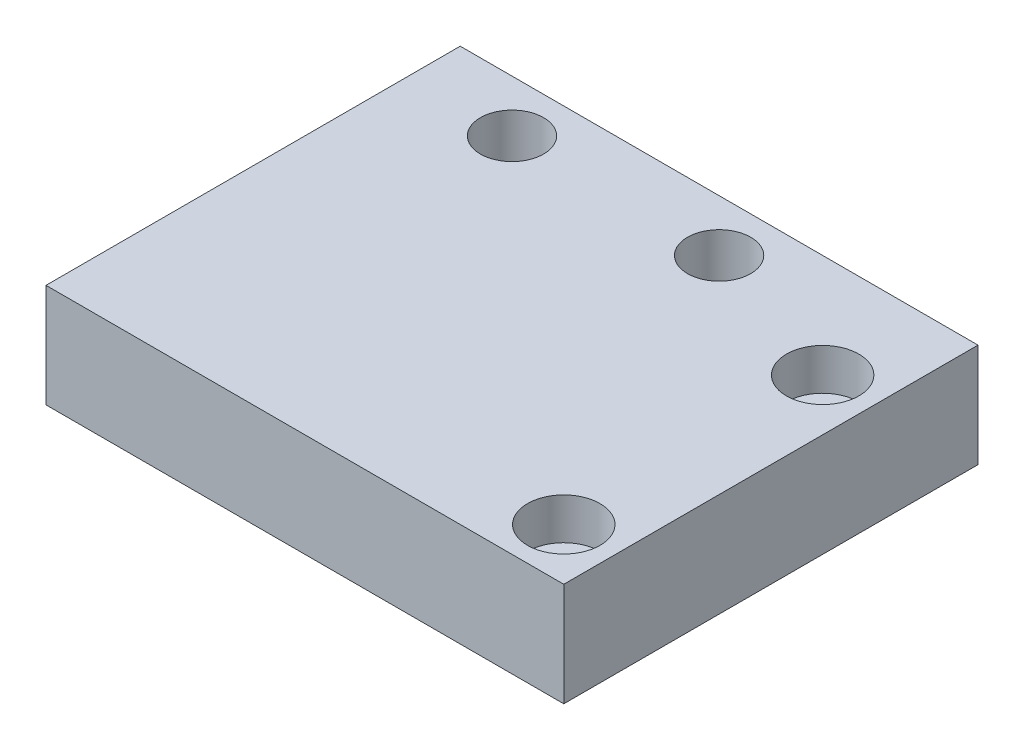
ISO-10303-21;
HEADER;
FILE_DESCRIPTION(('STEP AP214'),'2;1');
FILE_NAME('part.step','',(''),(''),'','','');
FILE_SCHEMA(('AUTOMOTIVE_DESIGN { 1 0 10303 214 1 1 1 1 }'));
ENDSEC;
DATA;
#1=APPLICATION_CONTEXT('core data for automotive mechanical design processes');
#2=APPLICATION_PROTOCOL_DEFINITION('international standard','automotive_design',2000,#1);
#3=PRODUCT_CONTEXT('',#1,'mechanical');
#4=PRODUCT('Part','Part','',(#3));
#5=PRODUCT_RELATED_PRODUCT_CATEGORY('part','',(#4));
#6=PRODUCT_DEFINITION_FORMATION('','',#4);
#7=PRODUCT_DEFINITION_CONTEXT('part definition',#1,'design');
#8=PRODUCT_DEFINITION('design','',#6,#7);
#9=PRODUCT_DEFINITION_SHAPE('','',#8);
#10=(LENGTH_UNIT() NAMED_UNIT(*) SI_UNIT(.MILLI.,.METRE.));
#11=(NAMED_UNIT(*) PLANE_ANGLE_UNIT() SI_UNIT($,.RADIAN.));
#12=(NAMED_UNIT(*) SI_UNIT($,.STERADIAN.) SOLID_ANGLE_UNIT());
#13=UNCERTAINTY_MEASURE_WITH_UNIT(LENGTH_MEASURE(1.E-05),#10,'distance_accuracy_value','');
#14=(GEOMETRIC_REPRESENTATION_CONTEXT(3) GLOBAL_UNCERTAINTY_ASSIGNED_CONTEXT((#13)) GLOBAL_UNIT_ASSIGNED_CONTEXT((#10,
#11,#12)) REPRESENTATION_CONTEXT('',''));
#15=CARTESIAN_POINT('',(0.,0.,0.));
#16=DIRECTION('',(0.,0.,1.));
#17=DIRECTION('',(1.,0.,0.));
#18=AXIS2_PLACEMENT_3D('',#15,#16,#17);
#19=CARTESIAN_POINT('',(20.,-5.65685424949239,15.));
#20=DIRECTION('',(0.,1.,0.));
#21=DIRECTION('',(0.,0.,1.));
#22=AXIS2_PLACEMENT_3D('',#19,#20,#21);
#23=CYLINDRICAL_SURFACE('',#22,2.);
#24=CARTESIAN_POINT('',(20.,0.,15.));
#25=DIRECTION('',(0.,1.,0.));
#26=DIRECTION('',(0.,0.,1.));
#27=AXIS2_PLACEMENT_3D('',#24,#25,#26);
#28=CIRCLE('',#27,2.);
#29=CARTESIAN_POINT('',(20.,0.,17.));
#30=VERTEX_POINT('',#29);
#31=EDGE_CURVE('E112',#30,#30,#28,.F.);
#32=ORIENTED_EDGE('',*,*,#31,.T.);
#33=EDGE_LOOP('',(#32));
#34=FACE_BOUND('',#33,.T.);
#35=CARTESIAN_POINT('',(20.,6.,15.));
#36=DIRECTION('',(0.,1.,0.));
#37=DIRECTION('',(0.,0.,1.));
#38=AXIS2_PLACEMENT_3D('',#35,#36,#37);
#39=CIRCLE('',#38,2.);
#40=CARTESIAN_POINT('',(20.,6.,17.));
#41=VERTEX_POINT('',#40);
#42=EDGE_CURVE('E39',#41,#41,#39,.F.);
#43=ORIENTED_EDGE('',*,*,#42,.F.);
#44=EDGE_LOOP('',(#43));
#45=FACE_BOUND('',#44,.T.);
#46=ADVANCED_FACE('F35',(#34,#45),#23,.F.);
#47=CARTESIAN_POINT('',(20.,-5.79827560572969,-9.99999999999999));
#48=DIRECTION('',(0.,1.,0.));
#49=DIRECTION('',(0.,0.,1.));
#50=AXIS2_PLACEMENT_3D('',#47,#48,#49);
#51=CYLINDRICAL_SURFACE('',#50,2.05);
#52=CARTESIAN_POINT('',(20.,0.,-9.99999999999999));
#53=DIRECTION('',(0.,1.,0.));
#54=DIRECTION('',(0.,0.,1.));
#55=AXIS2_PLACEMENT_3D('',#52,#53,#54);
#56=CIRCLE('',#55,2.05);
#57=CARTESIAN_POINT('',(20.,0.,-7.94999999999999));
#58=VERTEX_POINT('',#57);
#59=EDGE_CURVE('E105',#58,#58,#56,.F.);
#60=ORIENTED_EDGE('',*,*,#59,.T.);
#61=EDGE_LOOP('',(#60));
#62=FACE_BOUND('',#61,.T.);
#63=CARTESIAN_POINT('',(20.,6.,-9.99999999999999));
#64=DIRECTION('',(0.,1.,0.));
#65=DIRECTION('',(0.,0.,1.));
#66=AXIS2_PLACEMENT_3D('',#63,#64,#65);
#67=CIRCLE('',#66,2.05);
#68=CARTESIAN_POINT('',(20.,6.,-7.94999999999999));
#69=VERTEX_POINT('',#68);
#70=EDGE_CURVE('E110',#69,#69,#67,.F.);
#71=ORIENTED_EDGE('',*,*,#70,.F.);
#72=EDGE_LOOP('',(#71));
#73=FACE_BOUND('',#72,.T.);
#74=ADVANCED_FACE('F144',(#62,#73),#51,.F.);
#75=CARTESIAN_POINT('',(25.,10.,-20.));
#76=DIRECTION('',(-1.,0.,0.));
#77=DIRECTION('',(0.,0.,1.));
#78=AXIS2_PLACEMENT_3D('',#75,#76,#77);
#79=PLANE('',#78);
#80=DIRECTION('',(0.,0.,-1.));
#81=VECTOR('',#80,1.);
#82=CARTESIAN_POINT('',(25.,0.,-20.));
#83=LINE('',#82,#81);
#84=CARTESIAN_POINT('',(25.,0.,20.));
#85=VERTEX_POINT('',#84);
#86=CARTESIAN_POINT('',(25.,0.,-20.));
#87=VERTEX_POINT('',#86);
#88=EDGE_CURVE('E102',#85,#87,#83,.T.);
#89=ORIENTED_EDGE('',*,*,#88,.T.);
#90=DIRECTION('',(0.,-1.,0.));
#91=VECTOR('',#90,1.);
#92=CARTESIAN_POINT('',(25.,10.,-20.));
#93=LINE('',#92,#91);
#94=CARTESIAN_POINT('',(25.,10.,-20.));
#95=VERTEX_POINT('',#94);
#96=EDGE_CURVE('E11',#95,#87,#93,.T.);
#97=ORIENTED_EDGE('',*,*,#96,.F.);
#98=DIRECTION('',(0.,0.,-1.));
#99=VECTOR('',#98,1.);
#100=CARTESIAN_POINT('',(25.,10.,-20.));
#101=LINE('',#100,#99);
#102=CARTESIAN_POINT('',(25.,10.,20.));
#103=VERTEX_POINT('',#102);
#104=EDGE_CURVE('E89',#103,#95,#101,.T.);
#105=ORIENTED_EDGE('',*,*,#104,.F.);
#106=DIRECTION('',(0.,-1.,0.));
#107=VECTOR('',#106,1.);
#108=CARTESIAN_POINT('',(25.,10.,20.));
#109=LINE('',#108,#107);
#110=EDGE_CURVE('E98',#103,#85,#109,.T.);
#111=ORIENTED_EDGE('',*,*,#110,.T.);
#112=EDGE_LOOP('',(#89,#97,#105,#111));
#113=FACE_BOUND('',#112,.T.);
#114=ADVANCED_FACE('F37',(#113),#79,.F.);
#115=CARTESIAN_POINT('',(-25.,10.,-20.));
#116=DIRECTION('',(0.,0.,1.));
#117=DIRECTION('',(1.,0.,0.));
#118=AXIS2_PLACEMENT_3D('',#115,#116,#117);
#119=PLANE('',#118);
#120=DIRECTION('',(-1.,0.,0.));
#121=VECTOR('',#120,1.);
#122=CARTESIAN_POINT('',(-25.,0.,-20.));
#123=LINE('',#122,#121);
#124=CARTESIAN_POINT('',(-25.,0.,-20.));
#125=VERTEX_POINT('',#124);
#126=EDGE_CURVE('E93',#87,#125,#123,.T.);
#127=ORIENTED_EDGE('',*,*,#126,.T.);
#128=DIRECTION('',(0.,-1.,0.));
#129=VECTOR('',#128,1.);
#130=CARTESIAN_POINT('',(-25.,10.,-20.));
#131=LINE('',#130,#129);
#132=CARTESIAN_POINT('',(-25.,10.,-20.));
#133=VERTEX_POINT('',#132);
#134=EDGE_CURVE('E45',#133,#125,#131,.T.);
#135=ORIENTED_EDGE('',*,*,#134,.F.);
#136=DIRECTION('',(-1.,0.,0.));
#137=VECTOR('',#136,1.);
#138=CARTESIAN_POINT('',(-25.,10.,-20.));
#139=LINE('',#138,#137);
#140=EDGE_CURVE('E84',#95,#133,#139,.T.);
#141=ORIENTED_EDGE('',*,*,#140,.F.);
#142=ORIENTED_EDGE('',*,*,#96,.T.);
#143=EDGE_LOOP('',(#127,#135,#141,#142));
#144=FACE_BOUND('',#143,.T.);
#145=ADVANCED_FACE('F92',(#144),#119,.F.);
#146=CARTESIAN_POINT('',(-25.,10.,-20.));
#147=DIRECTION('',(1.,0.,0.));
#148=DIRECTION('',(0.,0.,-1.));
#149=AXIS2_PLACEMENT_3D('',#146,#147,#148);
#150=PLANE('',#149);
#151=DIRECTION('',(0.,0.,1.));
#152=VECTOR('',#151,1.);
#153=CARTESIAN_POINT('',(-25.,0.,-20.));
#154=LINE('',#153,#152);
#155=CARTESIAN_POINT('',(-25.,0.,20.));
#156=VERTEX_POINT('',#155);
#157=EDGE_CURVE('E71',#125,#156,#154,.T.);
#158=ORIENTED_EDGE('',*,*,#157,.T.);
#159=DIRECTION('',(0.,-1.,0.));
#160=VECTOR('',#159,1.);
#161=CARTESIAN_POINT('',(-25.,10.,20.));
#162=LINE('',#161,#160);
#163=CARTESIAN_POINT('',(-25.,10.,20.));
#164=VERTEX_POINT('',#163);
#165=EDGE_CURVE('E94',#164,#156,#162,.T.);
#166=ORIENTED_EDGE('',*,*,#165,.F.);
#167=DIRECTION('',(0.,0.,1.));
#168=VECTOR('',#167,1.);
#169=CARTESIAN_POINT('',(-25.,10.,-20.));
#170=LINE('',#169,#168);
#171=EDGE_CURVE('E87',#133,#164,#170,.T.);
#172=ORIENTED_EDGE('',*,*,#171,.F.);
#173=ORIENTED_EDGE('',*,*,#134,.T.);
#174=EDGE_LOOP('',(#158,#166,#172,#173));
#175=FACE_BOUND('',#174,.T.);
#176=ADVANCED_FACE('F96',(#175),#150,.F.);
#177=CARTESIAN_POINT('',(-25.,10.,20.));
#178=DIRECTION('',(0.,0.,-1.));
#179=DIRECTION('',(-1.,0.,0.));
#180=AXIS2_PLACEMENT_3D('',#177,#178,#179);
#181=PLANE('',#180);
#182=DIRECTION('',(1.,0.,0.));
#183=VECTOR('',#182,1.);
#184=CARTESIAN_POINT('',(-25.,0.,20.));
#185=LINE('',#184,#183);
#186=EDGE_CURVE('E77',#156,#85,#185,.T.);
#187=ORIENTED_EDGE('',*,*,#186,.T.);
#188=ORIENTED_EDGE('',*,*,#110,.F.);
#189=DIRECTION('',(1.,0.,0.));
#190=VECTOR('',#189,1.);
#191=CARTESIAN_POINT('',(-25.,10.,20.));
#192=LINE('',#191,#190);
#193=EDGE_CURVE('E54',#164,#103,#192,.T.);
#194=ORIENTED_EDGE('',*,*,#193,.F.);
#195=ORIENTED_EDGE('',*,*,#165,.T.);
#196=EDGE_LOOP('',(#187,#188,#194,#195));
#197=FACE_BOUND('',#196,.T.);
#198=ADVANCED_FACE('F155',(#197),#181,.F.);
#199=CARTESIAN_POINT('',(0.,10.,0.));
#200=DIRECTION('',(0.,1.,0.));
#201=DIRECTION('',(0.,0.,1.));
#202=AXIS2_PLACEMENT_3D('',#199,#200,#201);
#203=PLANE('',#202);
#204=CARTESIAN_POINT('',(20.,10.,15.));
#205=DIRECTION('',(0.,1.,0.));
#206=DIRECTION('',(0.,0.,1.));
#207=AXIS2_PLACEMENT_3D('',#204,#205,#206);
#208=CIRCLE('',#207,3.5);
#209=CARTESIAN_POINT('',(20.,10.,18.5));
#210=VERTEX_POINT('',#209);
#211=EDGE_CURVE('E127',#210,#210,#208,.T.);
#212=ORIENTED_EDGE('',*,*,#211,.F.);
#213=EDGE_LOOP('',(#212));
#214=FACE_BOUND('',#213,.T.);
#215=CARTESIAN_POINT('',(20.,10.,-9.99999999999999));
#216=DIRECTION('',(0.,1.,0.));
#217=DIRECTION('',(0.,0.,1.));
#218=AXIS2_PLACEMENT_3D('',#215,#216,#217);
#219=CIRCLE('',#218,3.5);
#220=CARTESIAN_POINT('',(20.,10.,-6.5));
#221=VERTEX_POINT('',#220);
#222=EDGE_CURVE('E120',#221,#221,#219,.T.);
#223=ORIENTED_EDGE('',*,*,#222,.F.);
#224=EDGE_LOOP('',(#223));
#225=FACE_BOUND('',#224,.T.);
#226=CARTESIAN_POINT('',(-15.,10.,-15.));
#227=DIRECTION('',(0.,1.,0.));
#228=DIRECTION('',(0.,0.,1.));
#229=AXIS2_PLACEMENT_3D('',#226,#227,#228);
#230=CIRCLE('',#229,3.05);
#231=CARTESIAN_POINT('',(-15.,10.,-11.95));
#232=VERTEX_POINT('',#231);
#233=EDGE_CURVE('E130',#232,#232,#230,.T.);
#234=ORIENTED_EDGE('',*,*,#233,.F.);
#235=EDGE_LOOP('',(#234));
#236=FACE_BOUND('',#235,.T.);
#237=CARTESIAN_POINT('',(5.,10.,-15.));
#238=DIRECTION('',(0.,1.,0.));
#239=DIRECTION('',(0.,0.,1.));
#240=AXIS2_PLACEMENT_3D('',#237,#238,#239);
#241=CIRCLE('',#240,3.05);
#242=CARTESIAN_POINT('',(5.,10.,-11.95));
#243=VERTEX_POINT('',#242);
#244=EDGE_CURVE('E117',#243,#243,#241,.T.);
#245=ORIENTED_EDGE('',*,*,#244,.F.);
#246=EDGE_LOOP('',(#245));
#247=FACE_BOUND('',#246,.T.);
#248=ORIENTED_EDGE('',*,*,#104,.T.);
#249=ORIENTED_EDGE('',*,*,#140,.T.);
#250=ORIENTED_EDGE('',*,*,#171,.T.);
#251=ORIENTED_EDGE('',*,*,#193,.T.);
#252=EDGE_LOOP('',(#248,#249,#250,#251));
#253=FACE_BOUND('',#252,.T.);
#254=ADVANCED_FACE('F85',(#214,#225,#236,#247,#253),#203,.T.);
#255=CARTESIAN_POINT('',(0.,0.,0.));
#256=DIRECTION('',(0.,1.,0.));
#257=DIRECTION('',(0.,0.,1.));
#258=AXIS2_PLACEMENT_3D('',#255,#256,#257);
#259=PLANE('',#258);
#260=ORIENTED_EDGE('',*,*,#31,.F.);
#261=EDGE_LOOP('',(#260));
#262=FACE_BOUND('',#261,.T.);
#263=CARTESIAN_POINT('',(-15.,0.,-15.));
#264=DIRECTION('',(0.,1.,0.));
#265=DIRECTION('',(0.,0.,1.));
#266=AXIS2_PLACEMENT_3D('',#263,#264,#265);
#267=CIRCLE('',#266,3.05);
#268=CARTESIAN_POINT('',(-15.,0.,-11.95));
#269=VERTEX_POINT('',#268);
#270=EDGE_CURVE('E133',#269,#269,#267,.F.);
#271=ORIENTED_EDGE('',*,*,#270,.F.);
#272=EDGE_LOOP('',(#271));
#273=FACE_BOUND('',#272,.T.);
#274=CARTESIAN_POINT('',(5.,0.,-15.));
#275=DIRECTION('',(0.,1.,0.));
#276=DIRECTION('',(0.,0.,1.));
#277=AXIS2_PLACEMENT_3D('',#274,#275,#276);
#278=CIRCLE('',#277,3.05);
#279=CARTESIAN_POINT('',(5.,0.,-11.95));
#280=VERTEX_POINT('',#279);
#281=EDGE_CURVE('E134',#280,#280,#278,.F.);
#282=ORIENTED_EDGE('',*,*,#281,.F.);
#283=EDGE_LOOP('',(#282));
#284=FACE_BOUND('',#283,.T.);
#285=ORIENTED_EDGE('',*,*,#59,.F.);
#286=EDGE_LOOP('',(#285));
#287=FACE_BOUND('',#286,.T.);
#288=ORIENTED_EDGE('',*,*,#88,.F.);
#289=ORIENTED_EDGE('',*,*,#186,.F.);
#290=ORIENTED_EDGE('',*,*,#157,.F.);
#291=ORIENTED_EDGE('',*,*,#126,.F.);
#292=EDGE_LOOP('',(#288,#289,#290,#291));
#293=FACE_BOUND('',#292,.T.);
#294=ADVANCED_FACE('F147',(#262,#273,#284,#287,#293),#259,.F.);
#295=CARTESIAN_POINT('',(5.,-8.62670273047588,-15.));
#296=DIRECTION('',(0.,1.,0.));
#297=DIRECTION('',(0.,0.,1.));
#298=AXIS2_PLACEMENT_3D('',#295,#296,#297);
#299=CYLINDRICAL_SURFACE('',#298,3.05);
#300=ORIENTED_EDGE('',*,*,#281,.T.);
#301=EDGE_LOOP('',(#300));
#302=FACE_BOUND('',#301,.T.);
#303=ORIENTED_EDGE('',*,*,#244,.T.);
#304=EDGE_LOOP('',(#303));
#305=FACE_BOUND('',#304,.T.);
#306=ADVANCED_FACE('F150',(#302,#305),#299,.F.);
#307=CARTESIAN_POINT('',(-15.,-8.62670273047588,-15.));
#308=DIRECTION('',(0.,1.,0.));
#309=DIRECTION('',(0.,0.,1.));
#310=AXIS2_PLACEMENT_3D('',#307,#308,#309);
#311=CYLINDRICAL_SURFACE('',#310,3.05);
#312=ORIENTED_EDGE('',*,*,#270,.T.);
#313=EDGE_LOOP('',(#312));
#314=FACE_BOUND('',#313,.T.);
#315=ORIENTED_EDGE('',*,*,#233,.T.);
#316=EDGE_LOOP('',(#315));
#317=FACE_BOUND('',#316,.T.);
#318=ADVANCED_FACE('F177',(#314,#317),#311,.F.);
#319=CARTESIAN_POINT('',(20.,6.,-9.99999999999999));
#320=DIRECTION('',(0.,1.,0.));
#321=DIRECTION('',(0.,0.,1.));
#322=AXIS2_PLACEMENT_3D('',#319,#320,#321);
#323=PLANE('',#322);
#324=CARTESIAN_POINT('',(20.,6.,-9.99999999999999));
#325=DIRECTION('',(0.,1.,0.));
#326=DIRECTION('',(0.,0.,1.));
#327=AXIS2_PLACEMENT_3D('',#324,#325,#326);
#328=CIRCLE('',#327,3.5);
#329=CARTESIAN_POINT('',(20.,6.,-6.5));
#330=VERTEX_POINT('',#329);
#331=EDGE_CURVE('E113',#330,#330,#328,.T.);
#332=ORIENTED_EDGE('',*,*,#331,.T.);
#333=EDGE_LOOP('',(#332));
#334=FACE_BOUND('',#333,.T.);
#335=ORIENTED_EDGE('',*,*,#70,.T.);
#336=EDGE_LOOP('',(#335));
#337=FACE_BOUND('',#336,.T.);
#338=ADVANCED_FACE('F180',(#334,#337),#323,.T.);
#339=CARTESIAN_POINT('',(20.,6.,-9.99999999999999));
#340=DIRECTION('',(0.,1.,0.));
#341=DIRECTION('',(0.,0.,1.));
#342=AXIS2_PLACEMENT_3D('',#339,#340,#341);
#343=CYLINDRICAL_SURFACE('',#342,3.5);
#344=ORIENTED_EDGE('',*,*,#331,.F.);
#345=EDGE_LOOP('',(#344));
#346=FACE_BOUND('',#345,.T.);
#347=ORIENTED_EDGE('',*,*,#222,.T.);
#348=EDGE_LOOP('',(#347));
#349=FACE_BOUND('',#348,.T.);
#350=ADVANCED_FACE('F175',(#346,#349),#343,.F.);
#351=CARTESIAN_POINT('',(20.,6.,15.));
#352=DIRECTION('',(0.,1.,0.));
#353=DIRECTION('',(0.,0.,1.));
#354=AXIS2_PLACEMENT_3D('',#351,#352,#353);
#355=PLANE('',#354);
#356=CARTESIAN_POINT('',(20.,6.,15.));
#357=DIRECTION('',(0.,1.,0.));
#358=DIRECTION('',(0.,0.,1.));
#359=AXIS2_PLACEMENT_3D('',#356,#357,#358);
#360=CIRCLE('',#359,3.5);
#361=CARTESIAN_POINT('',(20.,6.,18.5));
#362=VERTEX_POINT('',#361);
#363=EDGE_CURVE('E285',#362,#362,#360,.T.);
#364=ORIENTED_EDGE('',*,*,#363,.T.);
#365=EDGE_LOOP('',(#364));
#366=FACE_BOUND('',#365,.T.);
#367=ORIENTED_EDGE('',*,*,#42,.T.);
#368=EDGE_LOOP('',(#367));
#369=FACE_BOUND('',#368,.T.);
#370=ADVANCED_FACE('F209',(#366,#369),#355,.T.);
#371=CARTESIAN_POINT('',(20.,6.,15.));
#372=DIRECTION('',(0.,1.,0.));
#373=DIRECTION('',(0.,0.,1.));
#374=AXIS2_PLACEMENT_3D('',#371,#372,#373);
#375=CYLINDRICAL_SURFACE('',#374,3.5);
#376=ORIENTED_EDGE('',*,*,#363,.F.);
#377=EDGE_LOOP('',(#376));
#378=FACE_BOUND('',#377,.T.);
#379=ORIENTED_EDGE('',*,*,#211,.T.);
#380=EDGE_LOOP('',(#379));
#381=FACE_BOUND('',#380,.T.);
#382=ADVANCED_FACE('F216',(#378,#381),#375,.F.);
#383=CLOSED_SHELL('',(#46,#74,#114,#145,#176,#198,#254,#294,#306,#318,#338,#350,#370,#382));
#384=MANIFOLD_SOLID_BREP('B2',#383);
#385=ADVANCED_BREP_SHAPE_REPRESENTATION('',(#18,#384),#14);
#386=SHAPE_DEFINITION_REPRESENTATION(#9,#385);
ENDSEC;
END-ISO-10303-21;
